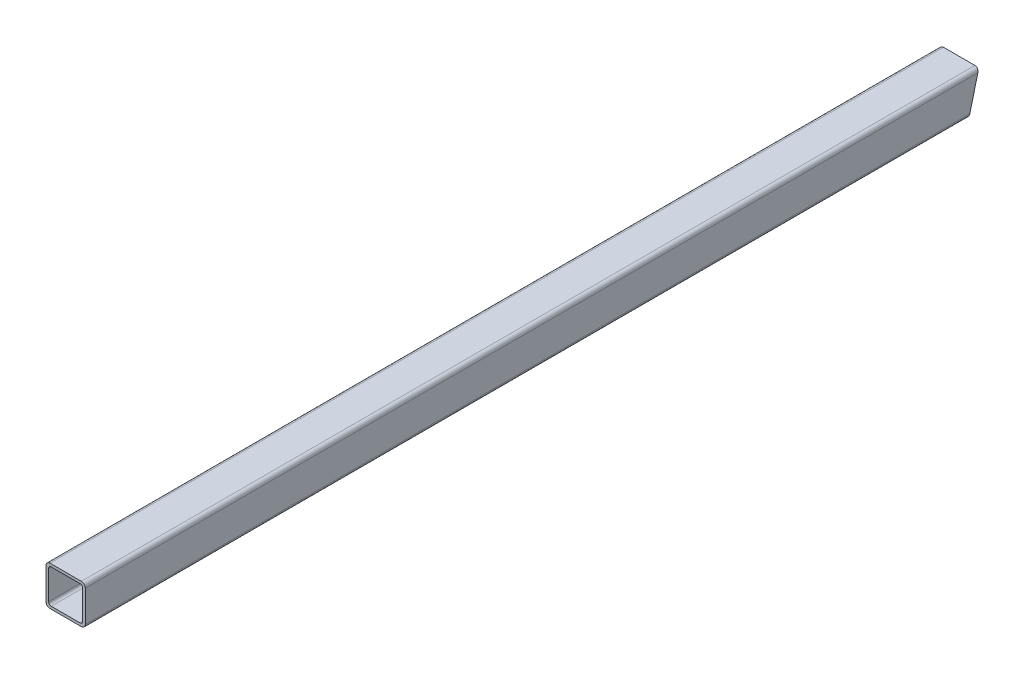
ISO-10303-21;
HEADER;
FILE_DESCRIPTION(('STEP AP214'),'2;1');
FILE_NAME('part.step','',(''),(''),'','','');
FILE_SCHEMA(('AUTOMOTIVE_DESIGN { 1 0 10303 214 1 1 1 1 }'));
ENDSEC;
DATA;
#1=APPLICATION_CONTEXT('core data for automotive mechanical design processes');
#2=APPLICATION_PROTOCOL_DEFINITION('international standard','automotive_design',2000,#1);
#3=PRODUCT_CONTEXT('',#1,'mechanical');
#4=PRODUCT('Part','Part','',(#3));
#5=PRODUCT_RELATED_PRODUCT_CATEGORY('part','',(#4));
#6=PRODUCT_DEFINITION_FORMATION('','',#4);
#7=PRODUCT_DEFINITION_CONTEXT('part definition',#1,'design');
#8=PRODUCT_DEFINITION('design','',#6,#7);
#9=PRODUCT_DEFINITION_SHAPE('','',#8);
#10=(LENGTH_UNIT() NAMED_UNIT(*) SI_UNIT(.MILLI.,.METRE.));
#11=(NAMED_UNIT(*) PLANE_ANGLE_UNIT() SI_UNIT($,.RADIAN.));
#12=(NAMED_UNIT(*) SI_UNIT($,.STERADIAN.) SOLID_ANGLE_UNIT());
#13=UNCERTAINTY_MEASURE_WITH_UNIT(LENGTH_MEASURE(1.E-05),#10,'distance_accuracy_value','');
#14=(GEOMETRIC_REPRESENTATION_CONTEXT(3) GLOBAL_UNCERTAINTY_ASSIGNED_CONTEXT((#13)) GLOBAL_UNIT_ASSIGNED_CONTEXT((#10,
#11,#12)) REPRESENTATION_CONTEXT('',''));
#15=CARTESIAN_POINT('',(0.,0.,0.));
#16=DIRECTION('',(0.,0.,1.));
#17=DIRECTION('',(1.,0.,0.));
#18=AXIS2_PLACEMENT_3D('',#15,#16,#17);
#19=CARTESIAN_POINT('',(-12.,-47.,-864.980118087263));
#20=DIRECTION('',(0.,0.,1.));
#21=DIRECTION('',(1.,0.,0.));
#22=AXIS2_PLACEMENT_3D('',#19,#20,#21);
#23=CYLINDRICAL_SURFACE('',#22,3.);
#24=CARTESIAN_POINT('',(-12.,-47.,-675.254414476805));
#25=DIRECTION('',(0.,0.246998383489726,0.969015891796137));
#26=DIRECTION('',(0.,-0.969015891796137,0.246998383489726));
#27=AXIS2_PLACEMENT_3D('',#24,#25,#26);
#28=ELLIPSE('',#27,3.09592445841038,3.);
#29=CARTESIAN_POINT('',(-12.,-50.,-674.489726140171));
#30=VERTEX_POINT('',#29);
#31=CARTESIAN_POINT('',(-15.,-47.,-675.254414476805));
#32=VERTEX_POINT('',#31);
#33=EDGE_CURVE('E143',#30,#32,#28,.F.);
#34=ORIENTED_EDGE('',*,*,#33,.F.);
#35=DIRECTION('',(0.,0.,1.));
#36=VECTOR('',#35,1.);
#37=CARTESIAN_POINT('',(-12.,-50.,-864.980118087263));
#38=LINE('',#37,#36);
#39=CARTESIAN_POINT('',(-12.,-50.,0.));
#40=VERTEX_POINT('',#39);
#41=EDGE_CURVE('E181',#30,#40,#38,.T.);
#42=ORIENTED_EDGE('',*,*,#41,.T.);
#43=CARTESIAN_POINT('',(-12.,-47.,0.));
#44=DIRECTION('',(0.,0.,1.));
#45=DIRECTION('',(1.,0.,0.));
#46=AXIS2_PLACEMENT_3D('',#43,#44,#45);
#47=CIRCLE('',#46,3.);
#48=CARTESIAN_POINT('',(-15.,-47.,0.));
#49=VERTEX_POINT('',#48);
#50=EDGE_CURVE('E164',#49,#40,#47,.T.);
#51=ORIENTED_EDGE('',*,*,#50,.F.);
#52=DIRECTION('',(0.,0.,1.));
#53=VECTOR('',#52,1.);
#54=CARTESIAN_POINT('',(-15.,-47.,-864.980118087263));
#55=LINE('',#54,#53);
#56=EDGE_CURVE('E41',#32,#49,#55,.T.);
#57=ORIENTED_EDGE('',*,*,#56,.F.);
#58=EDGE_LOOP('',(#34,#42,#51,#57));
#59=FACE_BOUND('',#58,.T.);
#60=ADVANCED_FACE('F34',(#59),#23,.T.);
#61=CARTESIAN_POINT('',(-15.,-23.,-864.980118087263));
#62=DIRECTION('',(-1.,0.,0.));
#63=DIRECTION('',(0.,0.,1.));
#64=AXIS2_PLACEMENT_3D('',#61,#62,#63);
#65=PLANE('',#64);
#66=DIRECTION('',(0.,0.969015891796137,-0.246998383489726));
#67=VECTOR('',#66,1.);
#68=CARTESIAN_POINT('',(-15.,-20.,-682.136609506508));
#69=LINE('',#68,#67);
#70=CARTESIAN_POINT('',(-15.,-23.,-681.371921169874));
#71=VERTEX_POINT('',#70);
#72=EDGE_CURVE('E146',#32,#71,#69,.T.);
#73=ORIENTED_EDGE('',*,*,#72,.F.);
#74=ORIENTED_EDGE('',*,*,#56,.T.);
#75=DIRECTION('',(0.,-1.,0.));
#76=VECTOR('',#75,1.);
#77=CARTESIAN_POINT('',(-15.,-23.,0.));
#78=LINE('',#77,#76);
#79=CARTESIAN_POINT('',(-15.,-23.,0.));
#80=VERTEX_POINT('',#79);
#81=EDGE_CURVE('E170',#80,#49,#78,.T.);
#82=ORIENTED_EDGE('',*,*,#81,.F.);
#83=DIRECTION('',(0.,0.,1.));
#84=VECTOR('',#83,1.);
#85=CARTESIAN_POINT('',(-15.,-23.,-864.980118087263));
#86=LINE('',#85,#84);
#87=EDGE_CURVE('E160',#71,#80,#86,.T.);
#88=ORIENTED_EDGE('',*,*,#87,.F.);
#89=EDGE_LOOP('',(#73,#74,#82,#88));
#90=FACE_BOUND('',#89,.T.);
#91=ADVANCED_FACE('F157',(#90),#65,.T.);
#92=CARTESIAN_POINT('',(-12.,-23.,-864.980118087263));
#93=DIRECTION('',(0.,0.,1.));
#94=DIRECTION('',(1.,0.,0.));
#95=AXIS2_PLACEMENT_3D('',#92,#93,#94);
#96=CYLINDRICAL_SURFACE('',#95,3.);
#97=CARTESIAN_POINT('',(-12.,-23.,-681.371921169874));
#98=DIRECTION('',(0.,0.246998383489726,0.969015891796137));
#99=DIRECTION('',(0.,-0.969015891796137,0.246998383489726));
#100=AXIS2_PLACEMENT_3D('',#97,#98,#99);
#101=ELLIPSE('',#100,3.09592445841037,3.);
#102=CARTESIAN_POINT('',(-12.,-20.,-682.136609506508));
#103=VERTEX_POINT('',#102);
#104=EDGE_CURVE('E153',#71,#103,#101,.F.);
#105=ORIENTED_EDGE('',*,*,#104,.F.);
#106=ORIENTED_EDGE('',*,*,#87,.T.);
#107=CARTESIAN_POINT('',(-12.,-23.,0.));
#108=DIRECTION('',(0.,0.,1.));
#109=DIRECTION('',(1.,0.,0.));
#110=AXIS2_PLACEMENT_3D('',#107,#108,#109);
#111=CIRCLE('',#110,3.);
#112=CARTESIAN_POINT('',(-12.,-20.,0.));
#113=VERTEX_POINT('',#112);
#114=EDGE_CURVE('E183',#113,#80,#111,.T.);
#115=ORIENTED_EDGE('',*,*,#114,.F.);
#116=DIRECTION('',(0.,0.,1.));
#117=VECTOR('',#116,1.);
#118=CARTESIAN_POINT('',(-12.,-20.,-864.980118087263));
#119=LINE('',#118,#117);
#120=EDGE_CURVE('E167',#103,#113,#119,.T.);
#121=ORIENTED_EDGE('',*,*,#120,.F.);
#122=EDGE_LOOP('',(#105,#106,#115,#121));
#123=FACE_BOUND('',#122,.T.);
#124=ADVANCED_FACE('F302',(#123),#96,.T.);
#125=CARTESIAN_POINT('',(-12.,-20.,-864.980118087263));
#126=DIRECTION('',(0.,1.,0.));
#127=DIRECTION('',(0.,0.,1.));
#128=AXIS2_PLACEMENT_3D('',#125,#126,#127);
#129=PLANE('',#128);
#130=DIRECTION('',(-1.,0.,0.));
#131=VECTOR('',#130,1.);
#132=CARTESIAN_POINT('',(15.,-20.,-682.136609506508));
#133=LINE('',#132,#131);
#134=CARTESIAN_POINT('',(12.,-20.,-682.136609506508));
#135=VERTEX_POINT('',#134);
#136=EDGE_CURVE('E266',#135,#103,#133,.T.);
#137=ORIENTED_EDGE('',*,*,#136,.T.);
#138=ORIENTED_EDGE('',*,*,#120,.T.);
#139=DIRECTION('',(-1.,0.,0.));
#140=VECTOR('',#139,1.);
#141=CARTESIAN_POINT('',(-12.,-20.,0.));
#142=LINE('',#141,#140);
#143=CARTESIAN_POINT('',(12.,-20.,0.));
#144=VERTEX_POINT('',#143);
#145=EDGE_CURVE('E186',#144,#113,#142,.T.);
#146=ORIENTED_EDGE('',*,*,#145,.F.);
#147=DIRECTION('',(0.,0.,1.));
#148=VECTOR('',#147,1.);
#149=CARTESIAN_POINT('',(12.,-20.,-864.980118087263));
#150=LINE('',#149,#148);
#151=EDGE_CURVE('E174',#135,#144,#150,.T.);
#152=ORIENTED_EDGE('',*,*,#151,.F.);
#153=EDGE_LOOP('',(#137,#138,#146,#152));
#154=FACE_BOUND('',#153,.T.);
#155=ADVANCED_FACE('F307',(#154),#129,.T.);
#156=CARTESIAN_POINT('',(12.,-23.,-864.980118087263));
#157=DIRECTION('',(0.,0.,1.));
#158=DIRECTION('',(1.,0.,0.));
#159=AXIS2_PLACEMENT_3D('',#156,#157,#158);
#160=CYLINDRICAL_SURFACE('',#159,3.);
#161=CARTESIAN_POINT('',(12.,-23.,-681.371921169874));
#162=DIRECTION('',(0.,0.246998383489726,0.969015891796137));
#163=DIRECTION('',(0.,-0.969015891796137,0.246998383489726));
#164=AXIS2_PLACEMENT_3D('',#161,#162,#163);
#165=ELLIPSE('',#164,3.09592445841038,3.);
#166=CARTESIAN_POINT('',(15.,-23.,-681.371921169874));
#167=VERTEX_POINT('',#166);
#168=EDGE_CURVE('E244',#135,#167,#165,.F.);
#169=ORIENTED_EDGE('',*,*,#168,.F.);
#170=ORIENTED_EDGE('',*,*,#151,.T.);
#171=CARTESIAN_POINT('',(12.,-23.,0.));
#172=DIRECTION('',(0.,0.,1.));
#173=DIRECTION('',(-1.,0.,0.));
#174=AXIS2_PLACEMENT_3D('',#171,#172,#173);
#175=CIRCLE('',#174,3.);
#176=CARTESIAN_POINT('',(15.,-23.,0.));
#177=VERTEX_POINT('',#176);
#178=EDGE_CURVE('E189',#177,#144,#175,.T.);
#179=ORIENTED_EDGE('',*,*,#178,.F.);
#180=DIRECTION('',(0.,0.,1.));
#181=VECTOR('',#180,1.);
#182=CARTESIAN_POINT('',(15.,-23.,-864.980118087263));
#183=LINE('',#182,#181);
#184=EDGE_CURVE('E176',#167,#177,#183,.T.);
#185=ORIENTED_EDGE('',*,*,#184,.F.);
#186=EDGE_LOOP('',(#169,#170,#179,#185));
#187=FACE_BOUND('',#186,.T.);
#188=ADVANCED_FACE('F279',(#187),#160,.T.);
#189=CARTESIAN_POINT('',(15.,-23.,-864.980118087263));
#190=DIRECTION('',(1.,0.,0.));
#191=DIRECTION('',(0.,1.,0.));
#192=AXIS2_PLACEMENT_3D('',#189,#190,#191);
#193=PLANE('',#192);
#194=DIRECTION('',(0.,0.969015891796137,-0.246998383489726));
#195=VECTOR('',#194,1.);
#196=CARTESIAN_POINT('',(15.,-20.,-682.136609506508));
#197=LINE('',#196,#195);
#198=CARTESIAN_POINT('',(15.,-47.,-675.254414476805));
#199=VERTEX_POINT('',#198);
#200=EDGE_CURVE('E161',#199,#167,#197,.T.);
#201=ORIENTED_EDGE('',*,*,#200,.T.);
#202=ORIENTED_EDGE('',*,*,#184,.T.);
#203=DIRECTION('',(0.,1.,0.));
#204=VECTOR('',#203,1.);
#205=CARTESIAN_POINT('',(15.,-23.,0.));
#206=LINE('',#205,#204);
#207=CARTESIAN_POINT('',(15.,-47.,0.));
#208=VERTEX_POINT('',#207);
#209=EDGE_CURVE('E194',#208,#177,#206,.T.);
#210=ORIENTED_EDGE('',*,*,#209,.F.);
#211=DIRECTION('',(0.,0.,1.));
#212=VECTOR('',#211,1.);
#213=CARTESIAN_POINT('',(15.,-47.,-864.980118087263));
#214=LINE('',#213,#212);
#215=EDGE_CURVE('E178',#199,#208,#214,.T.);
#216=ORIENTED_EDGE('',*,*,#215,.F.);
#217=EDGE_LOOP('',(#201,#202,#210,#216));
#218=FACE_BOUND('',#217,.T.);
#219=ADVANCED_FACE('F274',(#218),#193,.T.);
#220=CARTESIAN_POINT('',(12.,-47.,-864.980118087263));
#221=DIRECTION('',(0.,0.,1.));
#222=DIRECTION('',(1.,0.,0.));
#223=AXIS2_PLACEMENT_3D('',#220,#221,#222);
#224=CYLINDRICAL_SURFACE('',#223,3.);
#225=CARTESIAN_POINT('',(12.,-47.,-675.254414476805));
#226=DIRECTION('',(0.,0.246998383489726,0.969015891796137));
#227=DIRECTION('',(0.,-0.969015891796137,0.246998383489726));
#228=AXIS2_PLACEMENT_3D('',#225,#226,#227);
#229=ELLIPSE('',#228,3.09592445841037,3.);
#230=CARTESIAN_POINT('',(12.,-50.,-674.489726140171));
#231=VERTEX_POINT('',#230);
#232=EDGE_CURVE('E48',#199,#231,#229,.F.);
#233=ORIENTED_EDGE('',*,*,#232,.F.);
#234=ORIENTED_EDGE('',*,*,#215,.T.);
#235=CARTESIAN_POINT('',(12.,-47.,0.));
#236=DIRECTION('',(0.,0.,1.));
#237=DIRECTION('',(1.,0.,0.));
#238=AXIS2_PLACEMENT_3D('',#235,#236,#237);
#239=CIRCLE('',#238,3.);
#240=CARTESIAN_POINT('',(12.,-50.,0.));
#241=VERTEX_POINT('',#240);
#242=EDGE_CURVE('E197',#241,#208,#239,.T.);
#243=ORIENTED_EDGE('',*,*,#242,.F.);
#244=DIRECTION('',(0.,0.,1.));
#245=VECTOR('',#244,1.);
#246=CARTESIAN_POINT('',(12.,-50.,-864.980118087263));
#247=LINE('',#246,#245);
#248=EDGE_CURVE('E180',#231,#241,#247,.T.);
#249=ORIENTED_EDGE('',*,*,#248,.F.);
#250=EDGE_LOOP('',(#233,#234,#243,#249));
#251=FACE_BOUND('',#250,.T.);
#252=ADVANCED_FACE('F286',(#251),#224,.T.);
#253=CARTESIAN_POINT('',(-12.,-50.,-864.980118087263));
#254=DIRECTION('',(0.,-1.,0.));
#255=DIRECTION('',(0.,0.,-1.));
#256=AXIS2_PLACEMENT_3D('',#253,#254,#255);
#257=PLANE('',#256);
#258=DIRECTION('',(-1.,0.,0.));
#259=VECTOR('',#258,1.);
#260=CARTESIAN_POINT('',(15.,-50.,-674.489726140171));
#261=LINE('',#260,#259);
#262=EDGE_CURVE('E148',#231,#30,#261,.T.);
#263=ORIENTED_EDGE('',*,*,#262,.F.);
#264=ORIENTED_EDGE('',*,*,#248,.T.);
#265=DIRECTION('',(1.,0.,0.));
#266=VECTOR('',#265,1.);
#267=CARTESIAN_POINT('',(-12.,-50.,0.));
#268=LINE('',#267,#266);
#269=EDGE_CURVE('E200',#40,#241,#268,.T.);
#270=ORIENTED_EDGE('',*,*,#269,.F.);
#271=ORIENTED_EDGE('',*,*,#41,.F.);
#272=EDGE_LOOP('',(#263,#264,#270,#271));
#273=FACE_BOUND('',#272,.T.);
#274=ADVANCED_FACE('F288',(#273),#257,.T.);
#275=CARTESIAN_POINT('',(-12.,-47.,0.));
#276=DIRECTION('',(0.,0.,1.));
#277=DIRECTION('',(1.,0.,0.));
#278=AXIS2_PLACEMENT_3D('',#275,#276,#277);
#279=PLANE('',#278);
#280=CARTESIAN_POINT('',(-11.,-46.,0.));
#281=DIRECTION('',(0.,0.,1.));
#282=DIRECTION('',(1.,0.,0.));
#283=AXIS2_PLACEMENT_3D('',#280,#281,#282);
#284=CIRCLE('',#283,2.);
#285=CARTESIAN_POINT('',(-13.,-46.,0.));
#286=VERTEX_POINT('',#285);
#287=CARTESIAN_POINT('',(-11.,-48.,0.));
#288=VERTEX_POINT('',#287);
#289=EDGE_CURVE('E152',#286,#288,#284,.T.);
#290=ORIENTED_EDGE('',*,*,#289,.F.);
#291=DIRECTION('',(0.,-1.,0.));
#292=VECTOR('',#291,1.);
#293=CARTESIAN_POINT('',(-13.,-24.,0.));
#294=LINE('',#293,#292);
#295=CARTESIAN_POINT('',(-13.,-24.,0.));
#296=VERTEX_POINT('',#295);
#297=EDGE_CURVE('E208',#296,#286,#294,.T.);
#298=ORIENTED_EDGE('',*,*,#297,.F.);
#299=CARTESIAN_POINT('',(-11.,-24.,0.));
#300=DIRECTION('',(0.,0.,1.));
#301=DIRECTION('',(1.,0.,0.));
#302=AXIS2_PLACEMENT_3D('',#299,#300,#301);
#303=CIRCLE('',#302,2.);
#304=CARTESIAN_POINT('',(-11.,-22.,0.));
#305=VERTEX_POINT('',#304);
#306=EDGE_CURVE('E223',#305,#296,#303,.T.);
#307=ORIENTED_EDGE('',*,*,#306,.F.);
#308=DIRECTION('',(-1.,0.,0.));
#309=VECTOR('',#308,1.);
#310=CARTESIAN_POINT('',(-11.,-22.,0.));
#311=LINE('',#310,#309);
#312=CARTESIAN_POINT('',(11.,-22.,0.));
#313=VERTEX_POINT('',#312);
#314=EDGE_CURVE('E226',#313,#305,#311,.T.);
#315=ORIENTED_EDGE('',*,*,#314,.F.);
#316=CARTESIAN_POINT('',(11.,-24.,0.));
#317=DIRECTION('',(0.,0.,1.));
#318=DIRECTION('',(-1.,0.,0.));
#319=AXIS2_PLACEMENT_3D('',#316,#317,#318);
#320=CIRCLE('',#319,2.);
#321=CARTESIAN_POINT('',(13.,-24.,0.));
#322=VERTEX_POINT('',#321);
#323=EDGE_CURVE('E229',#322,#313,#320,.T.);
#324=ORIENTED_EDGE('',*,*,#323,.F.);
#325=DIRECTION('',(0.,1.,0.));
#326=VECTOR('',#325,1.);
#327=CARTESIAN_POINT('',(13.,-24.,0.));
#328=LINE('',#327,#326);
#329=CARTESIAN_POINT('',(13.,-46.,0.));
#330=VERTEX_POINT('',#329);
#331=EDGE_CURVE('E232',#330,#322,#328,.T.);
#332=ORIENTED_EDGE('',*,*,#331,.F.);
#333=CARTESIAN_POINT('',(11.,-46.,0.));
#334=DIRECTION('',(0.,0.,1.));
#335=DIRECTION('',(1.,0.,0.));
#336=AXIS2_PLACEMENT_3D('',#333,#334,#335);
#337=CIRCLE('',#336,2.);
#338=CARTESIAN_POINT('',(11.,-48.,0.));
#339=VERTEX_POINT('',#338);
#340=EDGE_CURVE('E235',#339,#330,#337,.T.);
#341=ORIENTED_EDGE('',*,*,#340,.F.);
#342=DIRECTION('',(1.,0.,0.));
#343=VECTOR('',#342,1.);
#344=CARTESIAN_POINT('',(-11.,-48.,0.));
#345=LINE('',#344,#343);
#346=EDGE_CURVE('E238',#288,#339,#345,.T.);
#347=ORIENTED_EDGE('',*,*,#346,.F.);
#348=EDGE_LOOP('',(#290,#298,#307,#315,#324,#332,#341,#347));
#349=FACE_BOUND('',#348,.T.);
#350=ORIENTED_EDGE('',*,*,#50,.T.);
#351=ORIENTED_EDGE('',*,*,#269,.T.);
#352=ORIENTED_EDGE('',*,*,#242,.T.);
#353=ORIENTED_EDGE('',*,*,#209,.T.);
#354=ORIENTED_EDGE('',*,*,#178,.T.);
#355=ORIENTED_EDGE('',*,*,#145,.T.);
#356=ORIENTED_EDGE('',*,*,#114,.T.);
#357=ORIENTED_EDGE('',*,*,#81,.T.);
#358=EDGE_LOOP('',(#350,#351,#352,#353,#354,#355,#356,#357));
#359=FACE_BOUND('',#358,.T.);
#360=ADVANCED_FACE('F282',(#349,#359),#279,.T.);
#361=CARTESIAN_POINT('',(-11.,-46.,-864.980118087263));
#362=DIRECTION('',(0.,0.,1.));
#363=DIRECTION('',(1.,0.,0.));
#364=AXIS2_PLACEMENT_3D('',#361,#362,#363);
#365=CYLINDRICAL_SURFACE('',#364,2.);
#366=DIRECTION('',(0.,0.,1.));
#367=VECTOR('',#366,1.);
#368=CARTESIAN_POINT('',(-11.,-48.,-864.980118087263));
#369=LINE('',#368,#367);
#370=CARTESIAN_POINT('',(-11.,-48.,-674.999518364593));
#371=VERTEX_POINT('',#370);
#372=EDGE_CURVE('E205',#371,#288,#369,.T.);
#373=ORIENTED_EDGE('',*,*,#372,.F.);
#374=CARTESIAN_POINT('',(-11.,-46.,-675.509310589016));
#375=DIRECTION('',(0.,0.246998383489726,0.969015891796137));
#376=DIRECTION('',(0.,-0.969015891796137,0.246998383489726));
#377=AXIS2_PLACEMENT_3D('',#374,#375,#376);
#378=ELLIPSE('',#377,2.06394963894025,2.);
#379=CARTESIAN_POINT('',(-13.,-46.,-675.509310589016));
#380=VERTEX_POINT('',#379);
#381=EDGE_CURVE('E56',#371,#380,#378,.F.);
#382=ORIENTED_EDGE('',*,*,#381,.T.);
#383=DIRECTION('',(0.,0.,1.));
#384=VECTOR('',#383,1.);
#385=CARTESIAN_POINT('',(-13.,-46.,-864.980118087263));
#386=LINE('',#385,#384);
#387=EDGE_CURVE('E204',#380,#286,#386,.T.);
#388=ORIENTED_EDGE('',*,*,#387,.T.);
#389=ORIENTED_EDGE('',*,*,#289,.T.);
#390=EDGE_LOOP('',(#373,#382,#388,#389));
#391=FACE_BOUND('',#390,.T.);
#392=ADVANCED_FACE('F294',(#391),#365,.F.);
#393=CARTESIAN_POINT('',(-13.,-24.,-864.980118087263));
#394=DIRECTION('',(-1.,0.,0.));
#395=DIRECTION('',(0.,0.,1.));
#396=AXIS2_PLACEMENT_3D('',#393,#394,#395);
#397=PLANE('',#396);
#398=ORIENTED_EDGE('',*,*,#387,.F.);
#399=DIRECTION('',(0.,0.969015891796137,-0.246998383489726));
#400=VECTOR('',#399,1.);
#401=CARTESIAN_POINT('',(-13.,20.0067779803489,-692.334181675796));
#402=LINE('',#401,#400);
#403=CARTESIAN_POINT('',(-13.,-24.,-681.117025057663));
#404=VERTEX_POINT('',#403);
#405=EDGE_CURVE('E248',#380,#404,#402,.T.);
#406=ORIENTED_EDGE('',*,*,#405,.T.);
#407=DIRECTION('',(0.,0.,1.));
#408=VECTOR('',#407,1.);
#409=CARTESIAN_POINT('',(-13.,-24.,-864.980118087263));
#410=LINE('',#409,#408);
#411=EDGE_CURVE('E218',#404,#296,#410,.T.);
#412=ORIENTED_EDGE('',*,*,#411,.T.);
#413=ORIENTED_EDGE('',*,*,#297,.T.);
#414=EDGE_LOOP('',(#398,#406,#412,#413));
#415=FACE_BOUND('',#414,.T.);
#416=ADVANCED_FACE('F340',(#415),#397,.F.);
#417=CARTESIAN_POINT('',(-11.,-24.,-864.980118087263));
#418=DIRECTION('',(0.,0.,1.));
#419=DIRECTION('',(1.,0.,0.));
#420=AXIS2_PLACEMENT_3D('',#417,#418,#419);
#421=CYLINDRICAL_SURFACE('',#420,2.);
#422=ORIENTED_EDGE('',*,*,#411,.F.);
#423=CARTESIAN_POINT('',(-11.,-24.,-681.117025057663));
#424=DIRECTION('',(0.,0.246998383489726,0.969015891796137));
#425=DIRECTION('',(0.,-0.969015891796137,0.246998383489726));
#426=AXIS2_PLACEMENT_3D('',#423,#424,#425);
#427=ELLIPSE('',#426,2.06394963894025,2.);
#428=CARTESIAN_POINT('',(-11.,-22.,-681.626817282085));
#429=VERTEX_POINT('',#428);
#430=EDGE_CURVE('E251',#404,#429,#427,.F.);
#431=ORIENTED_EDGE('',*,*,#430,.T.);
#432=DIRECTION('',(0.,0.,1.));
#433=VECTOR('',#432,1.);
#434=CARTESIAN_POINT('',(-11.,-22.,-864.980118087263));
#435=LINE('',#434,#433);
#436=EDGE_CURVE('E216',#429,#305,#435,.T.);
#437=ORIENTED_EDGE('',*,*,#436,.T.);
#438=ORIENTED_EDGE('',*,*,#306,.T.);
#439=EDGE_LOOP('',(#422,#431,#437,#438));
#440=FACE_BOUND('',#439,.T.);
#441=ADVANCED_FACE('F349',(#440),#421,.F.);
#442=CARTESIAN_POINT('',(-11.,-22.,-864.980118087263));
#443=DIRECTION('',(0.,1.,0.));
#444=DIRECTION('',(0.,0.,1.));
#445=AXIS2_PLACEMENT_3D('',#442,#443,#444);
#446=PLANE('',#445);
#447=ORIENTED_EDGE('',*,*,#436,.F.);
#448=DIRECTION('',(1.,0.,0.));
#449=VECTOR('',#448,1.);
#450=CARTESIAN_POINT('',(-11.,-22.,-681.626817282085));
#451=LINE('',#450,#449);
#452=CARTESIAN_POINT('',(11.,-22.,-681.626817282085));
#453=VERTEX_POINT('',#452);
#454=EDGE_CURVE('E254',#429,#453,#451,.T.);
#455=ORIENTED_EDGE('',*,*,#454,.T.);
#456=DIRECTION('',(0.,0.,1.));
#457=VECTOR('',#456,1.);
#458=CARTESIAN_POINT('',(11.,-22.,-864.980118087263));
#459=LINE('',#458,#457);
#460=EDGE_CURVE('E214',#453,#313,#459,.T.);
#461=ORIENTED_EDGE('',*,*,#460,.T.);
#462=ORIENTED_EDGE('',*,*,#314,.T.);
#463=EDGE_LOOP('',(#447,#455,#461,#462));
#464=FACE_BOUND('',#463,.T.);
#465=ADVANCED_FACE('F359',(#464),#446,.F.);
#466=CARTESIAN_POINT('',(11.,-24.,-864.980118087263));
#467=DIRECTION('',(0.,0.,1.));
#468=DIRECTION('',(1.,0.,0.));
#469=AXIS2_PLACEMENT_3D('',#466,#467,#468);
#470=CYLINDRICAL_SURFACE('',#469,2.);
#471=ORIENTED_EDGE('',*,*,#460,.F.);
#472=CARTESIAN_POINT('',(11.,-24.,-681.117025057663));
#473=DIRECTION('',(0.,0.246998383489726,0.969015891796137));
#474=DIRECTION('',(0.,-0.969015891796137,0.246998383489726));
#475=AXIS2_PLACEMENT_3D('',#472,#473,#474);
#476=ELLIPSE('',#475,2.06394963894025,2.);
#477=CARTESIAN_POINT('',(13.,-24.,-681.117025057663));
#478=VERTEX_POINT('',#477);
#479=EDGE_CURVE('E257',#453,#478,#476,.F.);
#480=ORIENTED_EDGE('',*,*,#479,.T.);
#481=DIRECTION('',(0.,0.,1.));
#482=VECTOR('',#481,1.);
#483=CARTESIAN_POINT('',(13.,-24.,-864.980118087263));
#484=LINE('',#483,#482);
#485=EDGE_CURVE('E212',#478,#322,#484,.T.);
#486=ORIENTED_EDGE('',*,*,#485,.T.);
#487=ORIENTED_EDGE('',*,*,#323,.T.);
#488=EDGE_LOOP('',(#471,#480,#486,#487));
#489=FACE_BOUND('',#488,.T.);
#490=ADVANCED_FACE('F369',(#489),#470,.F.);
#491=CARTESIAN_POINT('',(13.,-24.,-864.980118087263));
#492=DIRECTION('',(1.,0.,0.));
#493=DIRECTION('',(0.,0.,-1.));
#494=AXIS2_PLACEMENT_3D('',#491,#492,#493);
#495=PLANE('',#494);
#496=ORIENTED_EDGE('',*,*,#485,.F.);
#497=DIRECTION('',(0.,-0.969015891796137,0.246998383489726));
#498=VECTOR('',#497,1.);
#499=CARTESIAN_POINT('',(13.,20.0067779803489,-692.334181675796));
#500=LINE('',#499,#498);
#501=CARTESIAN_POINT('',(13.,-46.,-675.509310589016));
#502=VERTEX_POINT('',#501);
#503=EDGE_CURVE('E260',#478,#502,#500,.T.);
#504=ORIENTED_EDGE('',*,*,#503,.T.);
#505=DIRECTION('',(0.,0.,1.));
#506=VECTOR('',#505,1.);
#507=CARTESIAN_POINT('',(13.,-46.,-864.980118087263));
#508=LINE('',#507,#506);
#509=EDGE_CURVE('E210',#502,#330,#508,.T.);
#510=ORIENTED_EDGE('',*,*,#509,.T.);
#511=ORIENTED_EDGE('',*,*,#331,.T.);
#512=EDGE_LOOP('',(#496,#504,#510,#511));
#513=FACE_BOUND('',#512,.T.);
#514=ADVANCED_FACE('F379',(#513),#495,.F.);
#515=CARTESIAN_POINT('',(11.,-46.,-864.980118087263));
#516=DIRECTION('',(0.,0.,1.));
#517=DIRECTION('',(1.,0.,0.));
#518=AXIS2_PLACEMENT_3D('',#515,#516,#517);
#519=CYLINDRICAL_SURFACE('',#518,2.);
#520=ORIENTED_EDGE('',*,*,#509,.F.);
#521=CARTESIAN_POINT('',(11.,-46.,-675.509310589016));
#522=DIRECTION('',(0.,0.246998383489726,0.969015891796137));
#523=DIRECTION('',(0.,-0.969015891796137,0.246998383489726));
#524=AXIS2_PLACEMENT_3D('',#521,#522,#523);
#525=ELLIPSE('',#524,2.06394963894025,2.);
#526=CARTESIAN_POINT('',(11.,-48.,-674.999518364593));
#527=VERTEX_POINT('',#526);
#528=EDGE_CURVE('E263',#502,#527,#525,.F.);
#529=ORIENTED_EDGE('',*,*,#528,.T.);
#530=DIRECTION('',(0.,0.,1.));
#531=VECTOR('',#530,1.);
#532=CARTESIAN_POINT('',(11.,-48.,-864.980118087263));
#533=LINE('',#532,#531);
#534=EDGE_CURVE('E207',#527,#339,#533,.T.);
#535=ORIENTED_EDGE('',*,*,#534,.T.);
#536=ORIENTED_EDGE('',*,*,#340,.T.);
#537=EDGE_LOOP('',(#520,#529,#535,#536));
#538=FACE_BOUND('',#537,.T.);
#539=ADVANCED_FACE('F389',(#538),#519,.F.);
#540=CARTESIAN_POINT('',(-11.,-48.,-864.980118087263));
#541=DIRECTION('',(0.,-1.,0.));
#542=DIRECTION('',(0.,0.,-1.));
#543=AXIS2_PLACEMENT_3D('',#540,#541,#542);
#544=PLANE('',#543);
#545=ORIENTED_EDGE('',*,*,#534,.F.);
#546=DIRECTION('',(-1.,0.,0.));
#547=VECTOR('',#546,1.);
#548=CARTESIAN_POINT('',(-11.,-48.,-674.999518364593));
#549=LINE('',#548,#547);
#550=EDGE_CURVE('E11',#527,#371,#549,.T.);
#551=ORIENTED_EDGE('',*,*,#550,.T.);
#552=ORIENTED_EDGE('',*,*,#372,.T.);
#553=ORIENTED_EDGE('',*,*,#346,.T.);
#554=EDGE_LOOP('',(#545,#551,#552,#553));
#555=FACE_BOUND('',#554,.T.);
#556=ADVANCED_FACE('F399',(#555),#544,.F.);
#557=CARTESIAN_POINT('',(15.,-20.,-682.136609506508));
#558=DIRECTION('',(0.,0.246998383489726,0.969015891796137));
#559=DIRECTION('',(0.,-0.969015891796137,0.246998383489726));
#560=AXIS2_PLACEMENT_3D('',#557,#558,#559);
#561=PLANE('',#560);
#562=ORIENTED_EDGE('',*,*,#33,.T.);
#563=ORIENTED_EDGE('',*,*,#72,.T.);
#564=ORIENTED_EDGE('',*,*,#104,.T.);
#565=ORIENTED_EDGE('',*,*,#136,.F.);
#566=ORIENTED_EDGE('',*,*,#168,.T.);
#567=ORIENTED_EDGE('',*,*,#200,.F.);
#568=ORIENTED_EDGE('',*,*,#232,.T.);
#569=ORIENTED_EDGE('',*,*,#262,.T.);
#570=EDGE_LOOP('',(#562,#563,#564,#565,#566,#567,#568,#569));
#571=FACE_BOUND('',#570,.T.);
#572=ORIENTED_EDGE('',*,*,#550,.F.);
#573=ORIENTED_EDGE('',*,*,#528,.F.);
#574=ORIENTED_EDGE('',*,*,#503,.F.);
#575=ORIENTED_EDGE('',*,*,#479,.F.);
#576=ORIENTED_EDGE('',*,*,#454,.F.);
#577=ORIENTED_EDGE('',*,*,#430,.F.);
#578=ORIENTED_EDGE('',*,*,#405,.F.);
#579=ORIENTED_EDGE('',*,*,#381,.F.);
#580=EDGE_LOOP('',(#572,#573,#574,#575,#576,#577,#578,#579));
#581=FACE_BOUND('',#580,.T.);
#582=ADVANCED_FACE('F145',(#571,#581),#561,.F.);
#583=CLOSED_SHELL('',(#60,#91,#124,#155,#188,#219,#252,#274,#360,#392,#416,#441,#465,#490,#514,
#539,#556,#582));
#584=MANIFOLD_SOLID_BREP('B2',#583);
#585=ADVANCED_BREP_SHAPE_REPRESENTATION('',(#18,#584),#14);
#586=SHAPE_DEFINITION_REPRESENTATION(#9,#585);
ENDSEC;
END-ISO-10303-21;
